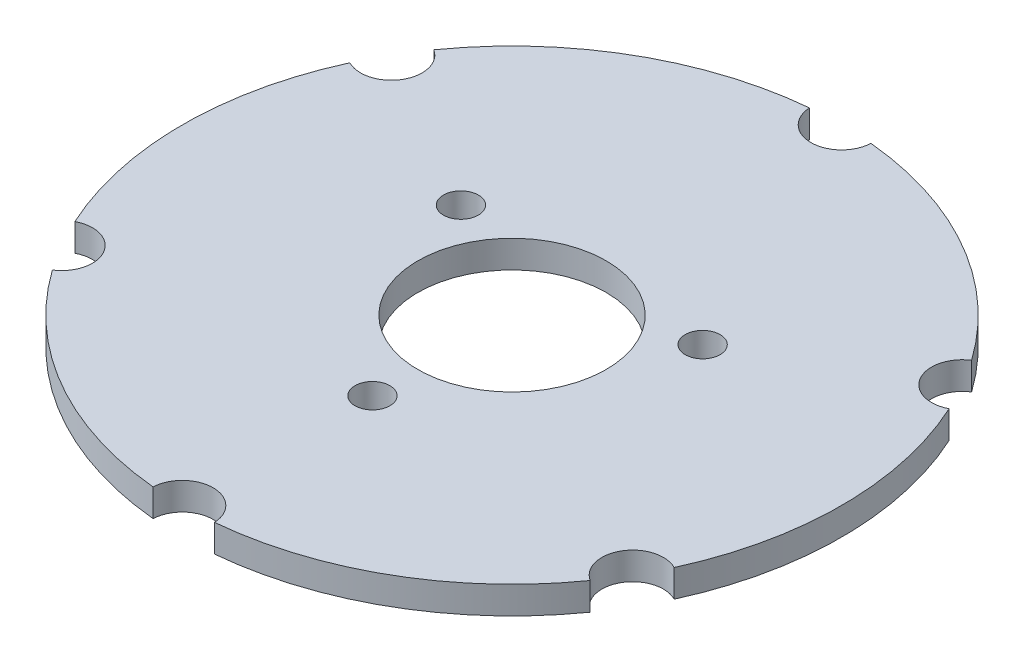
ISO-10303-21;
HEADER;
FILE_DESCRIPTION(('STEP AP214'),'2;1');
FILE_NAME('part.step','',(''),(''),'','','');
FILE_SCHEMA(('AUTOMOTIVE_DESIGN { 1 0 10303 214 1 1 1 1 }'));
ENDSEC;
DATA;
#1=APPLICATION_CONTEXT('core data for automotive mechanical design processes');
#2=APPLICATION_PROTOCOL_DEFINITION('international standard','automotive_design',2000,#1);
#3=PRODUCT_CONTEXT('',#1,'mechanical');
#4=PRODUCT('Part','Part','',(#3));
#5=PRODUCT_RELATED_PRODUCT_CATEGORY('part','',(#4));
#6=PRODUCT_DEFINITION_FORMATION('','',#4);
#7=PRODUCT_DEFINITION_CONTEXT('part definition',#1,'design');
#8=PRODUCT_DEFINITION('design','',#6,#7);
#9=PRODUCT_DEFINITION_SHAPE('','',#8);
#10=(LENGTH_UNIT() NAMED_UNIT(*) SI_UNIT(.MILLI.,.METRE.));
#11=(NAMED_UNIT(*) PLANE_ANGLE_UNIT() SI_UNIT($,.RADIAN.));
#12=(NAMED_UNIT(*) SI_UNIT($,.STERADIAN.) SOLID_ANGLE_UNIT());
#13=UNCERTAINTY_MEASURE_WITH_UNIT(LENGTH_MEASURE(1.E-05),#10,'distance_accuracy_value','');
#14=(GEOMETRIC_REPRESENTATION_CONTEXT(3) GLOBAL_UNCERTAINTY_ASSIGNED_CONTEXT((#13)) GLOBAL_UNIT_ASSIGNED_CONTEXT((#10,
#11,#12)) REPRESENTATION_CONTEXT('',''));
#15=CARTESIAN_POINT('',(0.,0.,0.));
#16=DIRECTION('',(0.,0.,1.));
#17=DIRECTION('',(1.,0.,0.));
#18=AXIS2_PLACEMENT_3D('',#15,#16,#17);
#19=CARTESIAN_POINT('',(0.,5.,0.));
#20=DIRECTION('',(0.,-1.,0.));
#21=DIRECTION('',(0.,0.,1.));
#22=AXIS2_PLACEMENT_3D('',#19,#20,#21);
#23=CYLINDRICAL_SURFACE('',#22,59.99988);
#24=CARTESIAN_POINT('',(0.,0.,0.));
#25=DIRECTION('',(0.,-1.,0.));
#26=DIRECTION('',(0.,0.,-1.));
#27=AXIS2_PLACEMENT_3D('',#24,#25,#26);
#28=CIRCLE('',#27,59.99988);
#29=CARTESIAN_POINT('',(54.5318099850476,0.,-25.0253331600013));
#30=VERTEX_POINT('',#29);
#31=CARTESIAN_POINT('',(54.5318099850471,0.,25.0253331600024));
#32=VERTEX_POINT('',#31);
#33=EDGE_CURVE('E127',#30,#32,#28,.T.);
#34=ORIENTED_EDGE('',*,*,#33,.F.);
#35=DIRECTION('',(0.,1.,0.));
#36=VECTOR('',#35,1.);
#37=CARTESIAN_POINT('',(54.5318099850476,2.5,-25.0253331600013));
#38=LINE('',#37,#36);
#39=CARTESIAN_POINT('',(54.5318099850476,5.,-25.0253331600013));
#40=VERTEX_POINT('',#39);
#41=EDGE_CURVE('E173',#40,#30,#38,.F.);
#42=ORIENTED_EDGE('',*,*,#41,.F.);
#43=CARTESIAN_POINT('',(0.,5.,0.));
#44=DIRECTION('',(0.,-1.,0.));
#45=DIRECTION('',(0.,0.,-1.));
#46=AXIS2_PLACEMENT_3D('',#43,#44,#45);
#47=CIRCLE('',#46,59.99988);
#48=CARTESIAN_POINT('',(54.5318099850471,5.,25.0253331600024));
#49=VERTEX_POINT('',#48);
#50=EDGE_CURVE('E355',#40,#49,#47,.T.);
#51=ORIENTED_EDGE('',*,*,#50,.T.);
#52=DIRECTION('',(0.,1.,0.));
#53=VECTOR('',#52,1.);
#54=CARTESIAN_POINT('',(54.5318099850471,2.5,25.0253331600024));
#55=LINE('',#54,#53);
#56=EDGE_CURVE('E135',#32,#49,#55,.T.);
#57=ORIENTED_EDGE('',*,*,#56,.F.);
#58=EDGE_LOOP('',(#34,#42,#51,#57));
#59=FACE_BOUND('',#58,.T.);
#60=ADVANCED_FACE('F34',(#59),#23,.T.);
#61=CARTESIAN_POINT('',(5.59333073779304,0.,-59.7385993413979));
#62=VERTEX_POINT('',#61);
#63=CARTESIAN_POINT('',(48.9384792472547,0.,-34.7132661813956));
#64=VERTEX_POINT('',#63);
#65=EDGE_CURVE('E143',#62,#64,#28,.T.);
#66=ORIENTED_EDGE('',*,*,#65,.F.);
#67=DIRECTION('',(0.,1.,0.));
#68=VECTOR('',#67,1.);
#69=CARTESIAN_POINT('',(5.59333073779304,2.5,-59.7385993413979));
#70=LINE('',#69,#68);
#71=CARTESIAN_POINT('',(5.59333073779304,5.,-59.7385993413979));
#72=VERTEX_POINT('',#71);
#73=EDGE_CURVE('E168',#72,#62,#70,.F.);
#74=ORIENTED_EDGE('',*,*,#73,.F.);
#75=CARTESIAN_POINT('',(48.9384792472547,5.,-34.7132661813956));
#76=VERTEX_POINT('',#75);
#77=EDGE_CURVE('E171',#72,#76,#47,.T.);
#78=ORIENTED_EDGE('',*,*,#77,.T.);
#79=DIRECTION('',(0.,1.,0.));
#80=VECTOR('',#79,1.);
#81=CARTESIAN_POINT('',(48.9384792472547,2.5,-34.7132661813956));
#82=LINE('',#81,#80);
#83=EDGE_CURVE('E169',#64,#76,#82,.T.);
#84=ORIENTED_EDGE('',*,*,#83,.F.);
#85=EDGE_LOOP('',(#66,#74,#78,#84));
#86=FACE_BOUND('',#85,.T.);
#87=ADVANCED_FACE('F166',(#86),#23,.T.);
#88=CARTESIAN_POINT('',(-48.9384792472542,0.,-34.7132661813963));
#89=VERTEX_POINT('',#88);
#90=CARTESIAN_POINT('',(-5.59333073779307,0.,-59.7385993413979));
#91=VERTEX_POINT('',#90);
#92=EDGE_CURVE('E156',#89,#91,#28,.T.);
#93=ORIENTED_EDGE('',*,*,#92,.F.);
#94=DIRECTION('',(0.,1.,0.));
#95=VECTOR('',#94,1.);
#96=CARTESIAN_POINT('',(-48.9384792472542,2.5,-34.7132661813963));
#97=LINE('',#96,#95);
#98=CARTESIAN_POINT('',(-48.9384792472542,5.,-34.7132661813963));
#99=VERTEX_POINT('',#98);
#100=EDGE_CURVE('E186',#99,#89,#97,.F.);
#101=ORIENTED_EDGE('',*,*,#100,.F.);
#102=CARTESIAN_POINT('',(-5.59333073779304,5.,-59.7385993413979));
#103=VERTEX_POINT('',#102);
#104=EDGE_CURVE('E335',#99,#103,#47,.T.);
#105=ORIENTED_EDGE('',*,*,#104,.T.);
#106=DIRECTION('',(0.,1.,0.));
#107=VECTOR('',#106,1.);
#108=CARTESIAN_POINT('',(-5.59333073779304,2.5,-59.7385993413979));
#109=LINE('',#108,#107);
#110=EDGE_CURVE('E181',#91,#103,#109,.T.);
#111=ORIENTED_EDGE('',*,*,#110,.F.);
#112=EDGE_LOOP('',(#93,#101,#105,#111));
#113=FACE_BOUND('',#112,.T.);
#114=ADVANCED_FACE('F260',(#113),#23,.T.);
#115=CARTESIAN_POINT('',(-54.5318099850475,0.,25.0253331600017));
#116=VERTEX_POINT('',#115);
#117=CARTESIAN_POINT('',(-54.5318099850473,0.,-25.025333160002));
#118=VERTEX_POINT('',#117);
#119=EDGE_CURVE('E150',#116,#118,#28,.T.);
#120=ORIENTED_EDGE('',*,*,#119,.F.);
#121=DIRECTION('',(0.,1.,0.));
#122=VECTOR('',#121,1.);
#123=CARTESIAN_POINT('',(-54.5318099850475,2.5,25.0253331600017));
#124=LINE('',#123,#122);
#125=CARTESIAN_POINT('',(-54.5318099850475,5.,25.0253331600017));
#126=VERTEX_POINT('',#125);
#127=EDGE_CURVE('E194',#126,#116,#124,.F.);
#128=ORIENTED_EDGE('',*,*,#127,.F.);
#129=CARTESIAN_POINT('',(-54.5318099850473,5.,-25.025333160002));
#130=VERTEX_POINT('',#129);
#131=EDGE_CURVE('E220',#126,#130,#47,.T.);
#132=ORIENTED_EDGE('',*,*,#131,.T.);
#133=DIRECTION('',(0.,1.,0.));
#134=VECTOR('',#133,1.);
#135=CARTESIAN_POINT('',(-54.5318099850473,2.5,-25.025333160002));
#136=LINE('',#135,#134);
#137=EDGE_CURVE('E189',#118,#130,#136,.T.);
#138=ORIENTED_EDGE('',*,*,#137,.F.);
#139=EDGE_LOOP('',(#120,#128,#132,#138));
#140=FACE_BOUND('',#139,.T.);
#141=ADVANCED_FACE('F251',(#140),#23,.T.);
#142=CARTESIAN_POINT('',(-5.59333073779304,0.,59.7385993413979));
#143=VERTEX_POINT('',#142);
#144=CARTESIAN_POINT('',(-48.9384792472544,0.,34.713266181396));
#145=VERTEX_POINT('',#144);
#146=EDGE_CURVE('E142',#143,#145,#28,.T.);
#147=ORIENTED_EDGE('',*,*,#146,.F.);
#148=DIRECTION('',(0.,1.,0.));
#149=VECTOR('',#148,1.);
#150=CARTESIAN_POINT('',(-5.59333073779304,2.5,59.7385993413979));
#151=LINE('',#150,#149);
#152=CARTESIAN_POINT('',(-5.59333073779304,5.,59.7385993413979));
#153=VERTEX_POINT('',#152);
#154=EDGE_CURVE('E202',#153,#143,#151,.F.);
#155=ORIENTED_EDGE('',*,*,#154,.F.);
#156=CARTESIAN_POINT('',(-48.9384792472544,5.,34.7132661813959));
#157=VERTEX_POINT('',#156);
#158=EDGE_CURVE('E216',#153,#157,#47,.T.);
#159=ORIENTED_EDGE('',*,*,#158,.T.);
#160=DIRECTION('',(0.,1.,0.));
#161=VECTOR('',#160,1.);
#162=CARTESIAN_POINT('',(-48.9384792472544,2.5,34.7132661813959));
#163=LINE('',#162,#161);
#164=EDGE_CURVE('E197',#145,#157,#163,.T.);
#165=ORIENTED_EDGE('',*,*,#164,.F.);
#166=EDGE_LOOP('',(#147,#155,#159,#165));
#167=FACE_BOUND('',#166,.T.);
#168=ADVANCED_FACE('F241',(#167),#23,.T.);
#169=CARTESIAN_POINT('',(-21.9970452561248,5.,-12.7));
#170=DIRECTION('',(0.,-1.,0.));
#171=DIRECTION('',(0.,0.,1.));
#172=AXIS2_PLACEMENT_3D('',#169,#170,#171);
#173=CYLINDRICAL_SURFACE('',#172,3.175);
#174=CARTESIAN_POINT('',(-21.9970452561248,5.,-12.7));
#175=DIRECTION('',(0.,-1.,0.));
#176=DIRECTION('',(0.,0.,-1.));
#177=AXIS2_PLACEMENT_3D('',#174,#175,#176);
#178=CIRCLE('',#177,3.175);
#179=CARTESIAN_POINT('',(-21.9970452561248,5.,-15.875));
#180=VERTEX_POINT('',#179);
#181=EDGE_CURVE('E212',#180,#180,#178,.T.);
#182=ORIENTED_EDGE('',*,*,#181,.F.);
#183=EDGE_LOOP('',(#182));
#184=FACE_BOUND('',#183,.T.);
#185=CARTESIAN_POINT('',(-21.9970452561248,0.,-12.7));
#186=DIRECTION('',(0.,-1.,0.));
#187=DIRECTION('',(0.,0.,-1.));
#188=AXIS2_PLACEMENT_3D('',#185,#186,#187);
#189=CIRCLE('',#188,3.175);
#190=CARTESIAN_POINT('',(-21.9970452561248,0.,-15.875));
#191=VERTEX_POINT('',#190);
#192=EDGE_CURVE('E140',#191,#191,#189,.T.);
#193=ORIENTED_EDGE('',*,*,#192,.T.);
#194=EDGE_LOOP('',(#193));
#195=FACE_BOUND('',#194,.T.);
#196=ADVANCED_FACE('F239',(#184,#195),#173,.F.);
#197=CARTESIAN_POINT('',(0.,5.,25.4));
#198=DIRECTION('',(0.,-1.,0.));
#199=DIRECTION('',(0.,0.,1.));
#200=AXIS2_PLACEMENT_3D('',#197,#198,#199);
#201=CYLINDRICAL_SURFACE('',#200,3.175);
#202=CARTESIAN_POINT('',(0.,5.,25.4));
#203=DIRECTION('',(0.,-1.,0.));
#204=DIRECTION('',(0.,0.,-1.));
#205=AXIS2_PLACEMENT_3D('',#202,#203,#204);
#206=CIRCLE('',#205,3.175);
#207=CARTESIAN_POINT('',(0.,5.,22.225));
#208=VERTEX_POINT('',#207);
#209=EDGE_CURVE('E209',#208,#208,#206,.T.);
#210=ORIENTED_EDGE('',*,*,#209,.F.);
#211=EDGE_LOOP('',(#210));
#212=FACE_BOUND('',#211,.T.);
#213=CARTESIAN_POINT('',(0.,0.,25.4));
#214=DIRECTION('',(0.,-1.,0.));
#215=DIRECTION('',(0.,0.,-1.));
#216=AXIS2_PLACEMENT_3D('',#213,#214,#215);
#217=CIRCLE('',#216,3.175);
#218=CARTESIAN_POINT('',(0.,0.,22.225));
#219=VERTEX_POINT('',#218);
#220=EDGE_CURVE('E145',#219,#219,#217,.T.);
#221=ORIENTED_EDGE('',*,*,#220,.T.);
#222=EDGE_LOOP('',(#221));
#223=FACE_BOUND('',#222,.T.);
#224=ADVANCED_FACE('F229',(#212,#223),#201,.F.);
#225=CARTESIAN_POINT('',(21.9970452561248,5.,-12.6999999999999));
#226=DIRECTION('',(0.,-1.,0.));
#227=DIRECTION('',(0.,0.,1.));
#228=AXIS2_PLACEMENT_3D('',#225,#226,#227);
#229=CYLINDRICAL_SURFACE('',#228,3.175);
#230=CARTESIAN_POINT('',(21.9970452561248,5.,-12.6999999999999));
#231=DIRECTION('',(0.,-1.,0.));
#232=DIRECTION('',(0.,0.,-1.));
#233=AXIS2_PLACEMENT_3D('',#230,#231,#232);
#234=CIRCLE('',#233,3.175);
#235=CARTESIAN_POINT('',(21.9970452561248,5.,-15.8749999999999));
#236=VERTEX_POINT('',#235);
#237=EDGE_CURVE('E153',#236,#236,#234,.T.);
#238=ORIENTED_EDGE('',*,*,#237,.F.);
#239=EDGE_LOOP('',(#238));
#240=FACE_BOUND('',#239,.T.);
#241=CARTESIAN_POINT('',(21.9970452561248,0.,-12.6999999999999));
#242=DIRECTION('',(0.,-1.,0.));
#243=DIRECTION('',(0.,0.,-1.));
#244=AXIS2_PLACEMENT_3D('',#241,#242,#243);
#245=CIRCLE('',#244,3.175);
#246=CARTESIAN_POINT('',(21.9970452561248,0.,-15.8749999999999));
#247=VERTEX_POINT('',#246);
#248=EDGE_CURVE('E223',#247,#247,#245,.T.);
#249=ORIENTED_EDGE('',*,*,#248,.T.);
#250=EDGE_LOOP('',(#249));
#251=FACE_BOUND('',#250,.T.);
#252=ADVANCED_FACE('F248',(#240,#251),#229,.F.);
#253=CARTESIAN_POINT('',(0.,5.,0.));
#254=DIRECTION('',(0.,-1.,0.));
#255=DIRECTION('',(0.,0.,1.));
#256=AXIS2_PLACEMENT_3D('',#253,#254,#255);
#257=CYLINDRICAL_SURFACE('',#256,17.145);
#258=CARTESIAN_POINT('',(0.,5.,0.));
#259=DIRECTION('',(0.,-1.,0.));
#260=DIRECTION('',(0.,0.,-1.));
#261=AXIS2_PLACEMENT_3D('',#258,#259,#260);
#262=CIRCLE('',#261,17.145);
#263=CARTESIAN_POINT('',(0.,5.,-17.145));
#264=VERTEX_POINT('',#263);
#265=EDGE_CURVE('E149',#264,#264,#262,.T.);
#266=ORIENTED_EDGE('',*,*,#265,.F.);
#267=EDGE_LOOP('',(#266));
#268=FACE_BOUND('',#267,.T.);
#269=CARTESIAN_POINT('',(0.,0.,0.));
#270=DIRECTION('',(0.,-1.,0.));
#271=DIRECTION('',(0.,0.,-1.));
#272=AXIS2_PLACEMENT_3D('',#269,#270,#271);
#273=CIRCLE('',#272,17.145);
#274=CARTESIAN_POINT('',(0.,0.,-17.145));
#275=VERTEX_POINT('',#274);
#276=EDGE_CURVE('E205',#275,#275,#273,.T.);
#277=ORIENTED_EDGE('',*,*,#276,.T.);
#278=EDGE_LOOP('',(#277));
#279=FACE_BOUND('',#278,.T.);
#280=ADVANCED_FACE('F36',(#268,#279),#257,.F.);
#281=CARTESIAN_POINT('',(48.938479247254,5.,34.7132661813966));
#282=VERTEX_POINT('',#281);
#283=CARTESIAN_POINT('',(5.59333073779304,5.,59.7385993413979));
#284=VERTEX_POINT('',#283);
#285=EDGE_CURVE('E215',#282,#284,#47,.T.);
#286=ORIENTED_EDGE('',*,*,#285,.T.);
#287=DIRECTION('',(0.,1.,0.));
#288=VECTOR('',#287,1.);
#289=CARTESIAN_POINT('',(5.59333073779304,2.5,59.7385993413979));
#290=LINE('',#289,#288);
#291=CARTESIAN_POINT('',(5.59333073779307,0.,59.7385993413979));
#292=VERTEX_POINT('',#291);
#293=EDGE_CURVE('E139',#292,#284,#290,.T.);
#294=ORIENTED_EDGE('',*,*,#293,.F.);
#295=CARTESIAN_POINT('',(48.938479247254,0.,34.7132661813966));
#296=VERTEX_POINT('',#295);
#297=EDGE_CURVE('E124',#296,#292,#28,.T.);
#298=ORIENTED_EDGE('',*,*,#297,.F.);
#299=DIRECTION('',(0.,1.,0.));
#300=VECTOR('',#299,1.);
#301=CARTESIAN_POINT('',(48.938479247254,2.5,34.7132661813966));
#302=LINE('',#301,#300);
#303=EDGE_CURVE('E129',#282,#296,#302,.F.);
#304=ORIENTED_EDGE('',*,*,#303,.F.);
#305=EDGE_LOOP('',(#286,#294,#298,#304));
#306=FACE_BOUND('',#305,.T.);
#307=ADVANCED_FACE('F137',(#306),#23,.T.);
#308=CARTESIAN_POINT('',(-132.141157356237,5.,0.));
#309=DIRECTION('',(0.,1.,0.));
#310=DIRECTION('',(0.,0.,-1.));
#311=AXIS2_PLACEMENT_3D('',#308,#309,#310);
#312=PLANE('',#311);
#313=CARTESIAN_POINT('',(51.9614203040175,5.,29.9999400000006));
#314=DIRECTION('',(0.,-1.,0.));
#315=DIRECTION('',(-0.866025403784433,0.,-0.50000000000001));
#316=AXIS2_PLACEMENT_3D('',#313,#314,#315);
#317=CIRCLE('',#316,5.59943);
#318=EDGE_CURVE('E131',#282,#49,#317,.T.);
#319=ORIENTED_EDGE('',*,*,#318,.T.);
#320=ORIENTED_EDGE('',*,*,#50,.F.);
#321=CARTESIAN_POINT('',(51.9614203040181,5.,-29.9999399999995));
#322=DIRECTION('',(0.,-1.,0.));
#323=DIRECTION('',(-0.866025403784443,0.,0.499999999999992));
#324=AXIS2_PLACEMENT_3D('',#321,#322,#323);
#325=CIRCLE('',#324,5.59943);
#326=EDGE_CURVE('E176',#40,#76,#325,.T.);
#327=ORIENTED_EDGE('',*,*,#326,.T.);
#328=ORIENTED_EDGE('',*,*,#77,.F.);
#329=CARTESIAN_POINT('',(0.,5.,-59.99988));
#330=DIRECTION('',(0.,-1.,0.));
#331=DIRECTION('',(0.,0.,1.));
#332=AXIS2_PLACEMENT_3D('',#329,#330,#331);
#333=CIRCLE('',#332,5.59943);
#334=EDGE_CURVE('E172',#72,#103,#333,.T.);
#335=ORIENTED_EDGE('',*,*,#334,.T.);
#336=ORIENTED_EDGE('',*,*,#104,.F.);
#337=CARTESIAN_POINT('',(-51.9614203040177,5.,-29.9999400000002));
#338=DIRECTION('',(0.,-1.,0.));
#339=DIRECTION('',(0.866025403784436,0.,0.500000000000004));
#340=AXIS2_PLACEMENT_3D('',#337,#338,#339);
#341=CIRCLE('',#340,5.59943);
#342=EDGE_CURVE('E184',#99,#130,#341,.T.);
#343=ORIENTED_EDGE('',*,*,#342,.T.);
#344=ORIENTED_EDGE('',*,*,#131,.F.);
#345=CARTESIAN_POINT('',(-51.9614203040179,5.,29.9999399999999));
#346=DIRECTION('',(0.,-1.,0.));
#347=DIRECTION('',(0.86602540378444,0.,-0.499999999999998));
#348=AXIS2_PLACEMENT_3D('',#345,#346,#347);
#349=CIRCLE('',#348,5.59943);
#350=EDGE_CURVE('E192',#126,#157,#349,.T.);
#351=ORIENTED_EDGE('',*,*,#350,.T.);
#352=ORIENTED_EDGE('',*,*,#158,.F.);
#353=CARTESIAN_POINT('',(0.,5.,59.99988));
#354=DIRECTION('',(0.,-1.,0.));
#355=DIRECTION('',(0.,0.,-1.));
#356=AXIS2_PLACEMENT_3D('',#353,#354,#355);
#357=CIRCLE('',#356,5.59943);
#358=EDGE_CURVE('E200',#153,#284,#357,.T.);
#359=ORIENTED_EDGE('',*,*,#358,.T.);
#360=ORIENTED_EDGE('',*,*,#285,.F.);
#361=EDGE_LOOP('',(#319,#320,#327,#328,#335,#336,#343,#344,#351,#352,#359,#360));
#362=FACE_BOUND('',#361,.T.);
#363=ORIENTED_EDGE('',*,*,#265,.T.);
#364=EDGE_LOOP('',(#363));
#365=FACE_BOUND('',#364,.T.);
#366=ORIENTED_EDGE('',*,*,#237,.T.);
#367=EDGE_LOOP('',(#366));
#368=FACE_BOUND('',#367,.T.);
#369=ORIENTED_EDGE('',*,*,#209,.T.);
#370=EDGE_LOOP('',(#369));
#371=FACE_BOUND('',#370,.T.);
#372=ORIENTED_EDGE('',*,*,#181,.T.);
#373=EDGE_LOOP('',(#372));
#374=FACE_BOUND('',#373,.T.);
#375=ADVANCED_FACE('F234',(#362,#365,#368,#371,#374),#312,.T.);
#376=CARTESIAN_POINT('',(-132.141157356237,0.,0.));
#377=DIRECTION('',(0.,1.,0.));
#378=DIRECTION('',(0.,0.,-1.));
#379=AXIS2_PLACEMENT_3D('',#376,#377,#378);
#380=PLANE('',#379);
#381=ORIENTED_EDGE('',*,*,#276,.F.);
#382=EDGE_LOOP('',(#381));
#383=FACE_BOUND('',#382,.T.);
#384=ORIENTED_EDGE('',*,*,#248,.F.);
#385=EDGE_LOOP('',(#384));
#386=FACE_BOUND('',#385,.T.);
#387=ORIENTED_EDGE('',*,*,#220,.F.);
#388=EDGE_LOOP('',(#387));
#389=FACE_BOUND('',#388,.T.);
#390=ORIENTED_EDGE('',*,*,#192,.F.);
#391=EDGE_LOOP('',(#390));
#392=FACE_BOUND('',#391,.T.);
#393=ORIENTED_EDGE('',*,*,#297,.T.);
#394=CARTESIAN_POINT('',(0.,0.,59.99988));
#395=DIRECTION('',(0.,-1.,0.));
#396=DIRECTION('',(0.,0.,-1.));
#397=AXIS2_PLACEMENT_3D('',#394,#395,#396);
#398=CIRCLE('',#397,5.59943);
#399=EDGE_CURVE('E219',#143,#292,#398,.T.);
#400=ORIENTED_EDGE('',*,*,#399,.F.);
#401=ORIENTED_EDGE('',*,*,#146,.T.);
#402=CARTESIAN_POINT('',(-51.9614203040179,0.,29.9999399999999));
#403=DIRECTION('',(0.,-1.,0.));
#404=DIRECTION('',(0.,0.,-1.));
#405=AXIS2_PLACEMENT_3D('',#402,#403,#404);
#406=CIRCLE('',#405,5.59943);
#407=EDGE_CURVE('E340',#116,#145,#406,.T.);
#408=ORIENTED_EDGE('',*,*,#407,.F.);
#409=ORIENTED_EDGE('',*,*,#119,.T.);
#410=CARTESIAN_POINT('',(-51.9614203040177,0.,-29.9999400000002));
#411=DIRECTION('',(0.,-1.,0.));
#412=DIRECTION('',(0.,0.,-1.));
#413=AXIS2_PLACEMENT_3D('',#410,#411,#412);
#414=CIRCLE('',#413,5.59943);
#415=EDGE_CURVE('E338',#89,#118,#414,.T.);
#416=ORIENTED_EDGE('',*,*,#415,.F.);
#417=ORIENTED_EDGE('',*,*,#92,.T.);
#418=CARTESIAN_POINT('',(0.,0.,-59.99988));
#419=DIRECTION('',(0.,-1.,0.));
#420=DIRECTION('',(0.,0.,-1.));
#421=AXIS2_PLACEMENT_3D('',#418,#419,#420);
#422=CIRCLE('',#421,5.59943);
#423=EDGE_CURVE('E162',#62,#91,#422,.T.);
#424=ORIENTED_EDGE('',*,*,#423,.F.);
#425=ORIENTED_EDGE('',*,*,#65,.T.);
#426=CARTESIAN_POINT('',(51.9614203040181,0.,-29.9999399999995));
#427=DIRECTION('',(0.,-1.,0.));
#428=DIRECTION('',(0.,0.,-1.));
#429=AXIS2_PLACEMENT_3D('',#426,#427,#428);
#430=CIRCLE('',#429,5.59943);
#431=EDGE_CURVE('E42',#30,#64,#430,.T.);
#432=ORIENTED_EDGE('',*,*,#431,.F.);
#433=ORIENTED_EDGE('',*,*,#33,.T.);
#434=CARTESIAN_POINT('',(51.9614203040175,0.,29.9999400000006));
#435=DIRECTION('',(0.,-1.,0.));
#436=DIRECTION('',(0.,0.,-1.));
#437=AXIS2_PLACEMENT_3D('',#434,#435,#436);
#438=CIRCLE('',#437,5.59943);
#439=EDGE_CURVE('E11',#296,#32,#438,.T.);
#440=ORIENTED_EDGE('',*,*,#439,.F.);
#441=EDGE_LOOP('',(#393,#400,#401,#408,#409,#416,#417,#424,#425,#432,#433,#440));
#442=FACE_BOUND('',#441,.T.);
#443=ADVANCED_FACE('F122',(#383,#386,#389,#392,#442),#380,.F.);
#444=CARTESIAN_POINT('',(0.,0.,59.99988));
#445=DIRECTION('',(0.,1.,0.));
#446=DIRECTION('',(0.,0.,-1.));
#447=AXIS2_PLACEMENT_3D('',#444,#445,#446);
#448=CYLINDRICAL_SURFACE('',#447,5.59943);
#449=ORIENTED_EDGE('',*,*,#399,.T.);
#450=ORIENTED_EDGE('',*,*,#293,.T.);
#451=ORIENTED_EDGE('',*,*,#358,.F.);
#452=ORIENTED_EDGE('',*,*,#154,.T.);
#453=EDGE_LOOP('',(#449,#450,#451,#452));
#454=FACE_BOUND('',#453,.T.);
#455=ADVANCED_FACE('F233',(#454),#448,.F.);
#456=CARTESIAN_POINT('',(-51.9614203040179,0.,29.9999399999999));
#457=DIRECTION('',(0.,1.,0.));
#458=DIRECTION('',(0.,0.,-1.));
#459=AXIS2_PLACEMENT_3D('',#456,#457,#458);
#460=CYLINDRICAL_SURFACE('',#459,5.59943);
#461=ORIENTED_EDGE('',*,*,#407,.T.);
#462=ORIENTED_EDGE('',*,*,#164,.T.);
#463=ORIENTED_EDGE('',*,*,#350,.F.);
#464=ORIENTED_EDGE('',*,*,#127,.T.);
#465=EDGE_LOOP('',(#461,#462,#463,#464));
#466=FACE_BOUND('',#465,.T.);
#467=ADVANCED_FACE('F348',(#466),#460,.F.);
#468=CARTESIAN_POINT('',(-51.9614203040177,0.,-29.9999400000002));
#469=DIRECTION('',(0.,1.,0.));
#470=DIRECTION('',(0.,0.,-1.));
#471=AXIS2_PLACEMENT_3D('',#468,#469,#470);
#472=CYLINDRICAL_SURFACE('',#471,5.59943);
#473=ORIENTED_EDGE('',*,*,#415,.T.);
#474=ORIENTED_EDGE('',*,*,#137,.T.);
#475=ORIENTED_EDGE('',*,*,#342,.F.);
#476=ORIENTED_EDGE('',*,*,#100,.T.);
#477=EDGE_LOOP('',(#473,#474,#475,#476));
#478=FACE_BOUND('',#477,.T.);
#479=ADVANCED_FACE('F354',(#478),#472,.F.);
#480=CARTESIAN_POINT('',(0.,0.,-59.99988));
#481=DIRECTION('',(0.,1.,0.));
#482=DIRECTION('',(0.,0.,-1.));
#483=AXIS2_PLACEMENT_3D('',#480,#481,#482);
#484=CYLINDRICAL_SURFACE('',#483,5.59943);
#485=ORIENTED_EDGE('',*,*,#423,.T.);
#486=ORIENTED_EDGE('',*,*,#110,.T.);
#487=ORIENTED_EDGE('',*,*,#334,.F.);
#488=ORIENTED_EDGE('',*,*,#73,.T.);
#489=EDGE_LOOP('',(#485,#486,#487,#488));
#490=FACE_BOUND('',#489,.T.);
#491=ADVANCED_FACE('F337',(#490),#484,.F.);
#492=CARTESIAN_POINT('',(51.9614203040181,0.,-29.9999399999995));
#493=DIRECTION('',(0.,1.,0.));
#494=DIRECTION('',(0.,0.,-1.));
#495=AXIS2_PLACEMENT_3D('',#492,#493,#494);
#496=CYLINDRICAL_SURFACE('',#495,5.59943);
#497=ORIENTED_EDGE('',*,*,#431,.T.);
#498=ORIENTED_EDGE('',*,*,#83,.T.);
#499=ORIENTED_EDGE('',*,*,#326,.F.);
#500=ORIENTED_EDGE('',*,*,#41,.T.);
#501=EDGE_LOOP('',(#497,#498,#499,#500));
#502=FACE_BOUND('',#501,.T.);
#503=ADVANCED_FACE('F361',(#502),#496,.F.);
#504=CARTESIAN_POINT('',(51.9614203040175,0.,29.9999400000006));
#505=DIRECTION('',(0.,1.,0.));
#506=DIRECTION('',(0.,0.,-1.));
#507=AXIS2_PLACEMENT_3D('',#504,#505,#506);
#508=CYLINDRICAL_SURFACE('',#507,5.59943);
#509=ORIENTED_EDGE('',*,*,#439,.T.);
#510=ORIENTED_EDGE('',*,*,#56,.T.);
#511=ORIENTED_EDGE('',*,*,#318,.F.);
#512=ORIENTED_EDGE('',*,*,#303,.T.);
#513=EDGE_LOOP('',(#509,#510,#511,#512));
#514=FACE_BOUND('',#513,.T.);
#515=ADVANCED_FACE('F130',(#514),#508,.F.);
#516=CLOSED_SHELL('',(#60,#87,#114,#141,#168,#196,#224,#252,#280,#307,#375,#443,#455,#467,#479,
#491,#503,#515));
#517=MANIFOLD_SOLID_BREP('B2',#516);
#518=ADVANCED_BREP_SHAPE_REPRESENTATION('',(#18,#517),#14);
#519=SHAPE_DEFINITION_REPRESENTATION(#9,#518);
ENDSEC;
END-ISO-10303-21;
